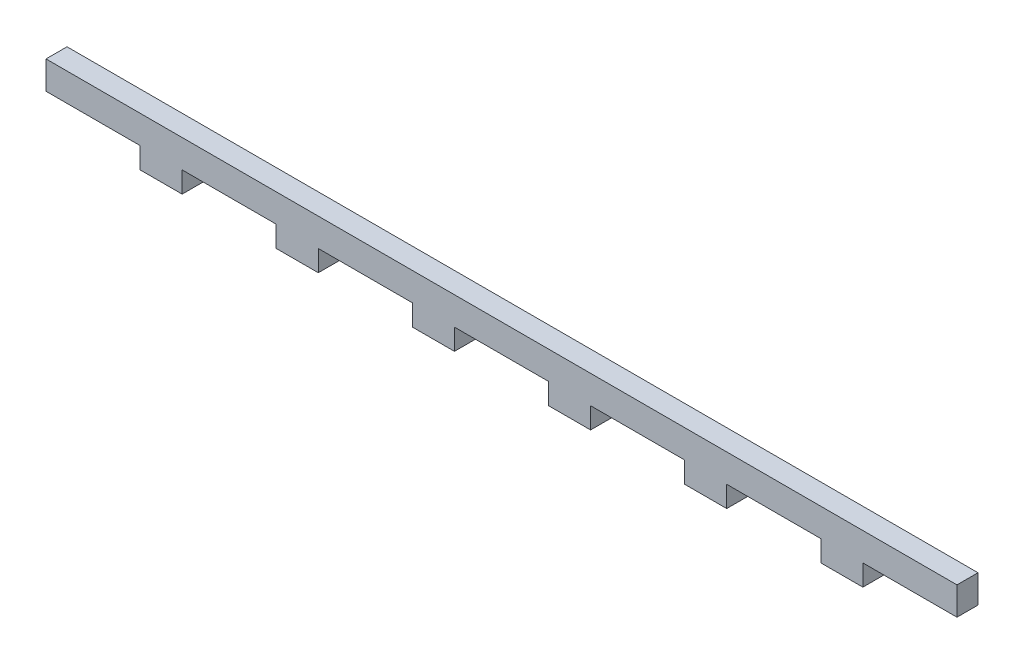
ISO-10303-21;
HEADER;
FILE_DESCRIPTION(('STEP AP214'),'2;1');
FILE_NAME('part.step','',(''),(''),'','','');
FILE_SCHEMA(('AUTOMOTIVE_DESIGN { 1 0 10303 214 1 1 1 1 }'));
ENDSEC;
DATA;
#1=APPLICATION_CONTEXT('core data for automotive mechanical design processes');
#2=APPLICATION_PROTOCOL_DEFINITION('international standard','automotive_design',2000,#1);
#3=PRODUCT_CONTEXT('',#1,'mechanical');
#4=PRODUCT('Part','Part','',(#3));
#5=PRODUCT_RELATED_PRODUCT_CATEGORY('part','',(#4));
#6=PRODUCT_DEFINITION_FORMATION('','',#4);
#7=PRODUCT_DEFINITION_CONTEXT('part definition',#1,'design');
#8=PRODUCT_DEFINITION('design','',#6,#7);
#9=PRODUCT_DEFINITION_SHAPE('','',#8);
#10=(LENGTH_UNIT() NAMED_UNIT(*) SI_UNIT(.MILLI.,.METRE.));
#11=(NAMED_UNIT(*) PLANE_ANGLE_UNIT() SI_UNIT($,.RADIAN.));
#12=(NAMED_UNIT(*) SI_UNIT($,.STERADIAN.) SOLID_ANGLE_UNIT());
#13=UNCERTAINTY_MEASURE_WITH_UNIT(LENGTH_MEASURE(1.E-05),#10,'distance_accuracy_value','');
#14=(GEOMETRIC_REPRESENTATION_CONTEXT(3) GLOBAL_UNCERTAINTY_ASSIGNED_CONTEXT((#13)) GLOBAL_UNIT_ASSIGNED_CONTEXT((#10,
#11,#12)) REPRESENTATION_CONTEXT('',''));
#15=CARTESIAN_POINT('',(0.,0.,0.));
#16=DIRECTION('',(0.,0.,1.));
#17=DIRECTION('',(1.,0.,0.));
#18=AXIS2_PLACEMENT_3D('',#15,#16,#17);
#19=CARTESIAN_POINT('',(-130.,-7.,-6.));
#20=DIRECTION('',(0.,-1.,0.));
#21=DIRECTION('',(0.,0.,-1.));
#22=AXIS2_PLACEMENT_3D('',#19,#20,#21);
#23=PLANE('',#22);
#24=DIRECTION('',(0.,0.,1.));
#25=VECTOR('',#24,1.);
#26=CARTESIAN_POINT('',(103.142857142857,-7.,-6.));
#27=LINE('',#26,#25);
#28=CARTESIAN_POINT('',(103.142857142857,-7.,-6.));
#29=VERTEX_POINT('',#28);
#30=CARTESIAN_POINT('',(103.142857142857,-7.,0.));
#31=VERTEX_POINT('',#30);
#32=EDGE_CURVE('E226',#29,#31,#27,.T.);
#33=ORIENTED_EDGE('',*,*,#32,.T.);
#34=DIRECTION('',(1.,0.,0.));
#35=VECTOR('',#34,1.);
#36=CARTESIAN_POINT('',(-130.,-7.,0.));
#37=LINE('',#36,#35);
#38=CARTESIAN_POINT('',(91.1428571428572,-7.,0.));
#39=VERTEX_POINT('',#38);
#40=EDGE_CURVE('E342',#39,#31,#37,.T.);
#41=ORIENTED_EDGE('',*,*,#40,.F.);
#42=DIRECTION('',(0.,0.,1.));
#43=VECTOR('',#42,1.);
#44=CARTESIAN_POINT('',(91.1428571428572,-7.,-6.));
#45=LINE('',#44,#43);
#46=CARTESIAN_POINT('',(91.1428571428572,-7.,-6.));
#47=VERTEX_POINT('',#46);
#48=EDGE_CURVE('E54',#47,#39,#45,.T.);
#49=ORIENTED_EDGE('',*,*,#48,.F.);
#50=DIRECTION('',(1.,0.,0.));
#51=VECTOR('',#50,1.);
#52=CARTESIAN_POINT('',(-130.,-7.,-6.));
#53=LINE('',#52,#51);
#54=EDGE_CURVE('E244',#47,#29,#53,.T.);
#55=ORIENTED_EDGE('',*,*,#54,.T.);
#56=EDGE_LOOP('',(#33,#41,#49,#55));
#57=FACE_BOUND('',#56,.T.);
#58=ADVANCED_FACE('F39',(#57),#23,.T.);
#59=DIRECTION('',(0.,0.,1.));
#60=VECTOR('',#59,1.);
#61=CARTESIAN_POINT('',(64.2857142857143,-7.,-6.));
#62=LINE('',#61,#60);
#63=CARTESIAN_POINT('',(64.2857142857143,-7.,-6.));
#64=VERTEX_POINT('',#63);
#65=CARTESIAN_POINT('',(64.2857142857143,-7.,0.));
#66=VERTEX_POINT('',#65);
#67=EDGE_CURVE('E306',#64,#66,#62,.T.);
#68=ORIENTED_EDGE('',*,*,#67,.T.);
#69=CARTESIAN_POINT('',(52.2857142857143,-7.,0.));
#70=VERTEX_POINT('',#69);
#71=EDGE_CURVE('E426',#70,#66,#37,.T.);
#72=ORIENTED_EDGE('',*,*,#71,.F.);
#73=DIRECTION('',(0.,0.,1.));
#74=VECTOR('',#73,1.);
#75=CARTESIAN_POINT('',(52.2857142857143,-7.,-6.));
#76=LINE('',#75,#74);
#77=CARTESIAN_POINT('',(52.2857142857143,-7.,-6.));
#78=VERTEX_POINT('',#77);
#79=EDGE_CURVE('E62',#78,#70,#76,.T.);
#80=ORIENTED_EDGE('',*,*,#79,.F.);
#81=EDGE_CURVE('E248',#78,#64,#53,.T.);
#82=ORIENTED_EDGE('',*,*,#81,.T.);
#83=EDGE_LOOP('',(#68,#72,#80,#82));
#84=FACE_BOUND('',#83,.T.);
#85=ADVANCED_FACE('F500',(#84),#23,.T.);
#86=DIRECTION('',(0.,0.,1.));
#87=VECTOR('',#86,1.);
#88=CARTESIAN_POINT('',(25.4285714285714,-7.,-6.));
#89=LINE('',#88,#87);
#90=CARTESIAN_POINT('',(25.4285714285714,-7.,-6.));
#91=VERTEX_POINT('',#90);
#92=CARTESIAN_POINT('',(25.4285714285714,-7.,0.));
#93=VERTEX_POINT('',#92);
#94=EDGE_CURVE('E284',#91,#93,#89,.T.);
#95=ORIENTED_EDGE('',*,*,#94,.T.);
#96=CARTESIAN_POINT('',(13.4285714285714,-7.,0.));
#97=VERTEX_POINT('',#96);
#98=EDGE_CURVE('E422',#97,#93,#37,.T.);
#99=ORIENTED_EDGE('',*,*,#98,.F.);
#100=DIRECTION('',(0.,0.,1.));
#101=VECTOR('',#100,1.);
#102=CARTESIAN_POINT('',(13.4285714285714,-7.,-6.));
#103=LINE('',#102,#101);
#104=CARTESIAN_POINT('',(13.4285714285714,-7.,-6.));
#105=VERTEX_POINT('',#104);
#106=EDGE_CURVE('E286',#105,#97,#103,.T.);
#107=ORIENTED_EDGE('',*,*,#106,.F.);
#108=EDGE_CURVE('E253',#105,#91,#53,.T.);
#109=ORIENTED_EDGE('',*,*,#108,.T.);
#110=EDGE_LOOP('',(#95,#99,#107,#109));
#111=FACE_BOUND('',#110,.T.);
#112=ADVANCED_FACE('F282',(#111),#23,.T.);
#113=CARTESIAN_POINT('',(0.,0.,-6.));
#114=DIRECTION('',(0.,0.,1.));
#115=DIRECTION('',(1.,0.,0.));
#116=AXIS2_PLACEMENT_3D('',#113,#114,#115);
#117=PLANE('',#116);
#118=DIRECTION('',(-1.,0.,0.));
#119=VECTOR('',#118,1.);
#120=CARTESIAN_POINT('',(0.,-1.,-6.));
#121=LINE('',#120,#119);
#122=CARTESIAN_POINT('',(130.,-1.,-6.));
#123=VERTEX_POINT('',#122);
#124=CARTESIAN_POINT('',(103.142857142857,-1.,-6.));
#125=VERTEX_POINT('',#124);
#126=EDGE_CURVE('E238',#123,#125,#121,.T.);
#127=ORIENTED_EDGE('',*,*,#126,.T.);
#128=DIRECTION('',(0.,-1.,0.));
#129=VECTOR('',#128,1.);
#130=CARTESIAN_POINT('',(103.142857142857,0.,-6.));
#131=LINE('',#130,#129);
#132=EDGE_CURVE('E229',#125,#29,#131,.T.);
#133=ORIENTED_EDGE('',*,*,#132,.T.);
#134=ORIENTED_EDGE('',*,*,#54,.F.);
#135=DIRECTION('',(0.,-1.,0.));
#136=VECTOR('',#135,1.);
#137=CARTESIAN_POINT('',(91.1428571428572,0.,-6.));
#138=LINE('',#137,#136);
#139=CARTESIAN_POINT('',(91.1428571428572,-1.,-6.));
#140=VERTEX_POINT('',#139);
#141=EDGE_CURVE('E508',#140,#47,#138,.T.);
#142=ORIENTED_EDGE('',*,*,#141,.F.);
#143=DIRECTION('',(-1.,0.,0.));
#144=VECTOR('',#143,1.);
#145=CARTESIAN_POINT('',(0.,-1.,-6.));
#146=LINE('',#145,#144);
#147=CARTESIAN_POINT('',(64.2857142857143,-1.,-6.));
#148=VERTEX_POINT('',#147);
#149=EDGE_CURVE('E505',#140,#148,#146,.T.);
#150=ORIENTED_EDGE('',*,*,#149,.T.);
#151=DIRECTION('',(0.,-1.,0.));
#152=VECTOR('',#151,1.);
#153=CARTESIAN_POINT('',(64.2857142857143,0.,-6.));
#154=LINE('',#153,#152);
#155=EDGE_CURVE('E511',#148,#64,#154,.T.);
#156=ORIENTED_EDGE('',*,*,#155,.T.);
#157=ORIENTED_EDGE('',*,*,#81,.F.);
#158=DIRECTION('',(0.,-1.,0.));
#159=VECTOR('',#158,1.);
#160=CARTESIAN_POINT('',(52.2857142857143,0.,-6.));
#161=LINE('',#160,#159);
#162=CARTESIAN_POINT('',(52.2857142857143,-1.,-6.));
#163=VERTEX_POINT('',#162);
#164=EDGE_CURVE('E298',#163,#78,#161,.T.);
#165=ORIENTED_EDGE('',*,*,#164,.F.);
#166=DIRECTION('',(-1.,0.,0.));
#167=VECTOR('',#166,1.);
#168=CARTESIAN_POINT('',(0.,-1.,-6.));
#169=LINE('',#168,#167);
#170=CARTESIAN_POINT('',(25.4285714285714,-1.,-6.));
#171=VERTEX_POINT('',#170);
#172=EDGE_CURVE('E296',#163,#171,#169,.T.);
#173=ORIENTED_EDGE('',*,*,#172,.T.);
#174=DIRECTION('',(0.,-1.,0.));
#175=VECTOR('',#174,1.);
#176=CARTESIAN_POINT('',(25.4285714285714,0.,-6.));
#177=LINE('',#176,#175);
#178=EDGE_CURVE('E293',#171,#91,#177,.T.);
#179=ORIENTED_EDGE('',*,*,#178,.T.);
#180=ORIENTED_EDGE('',*,*,#108,.F.);
#181=DIRECTION('',(0.,-1.,0.));
#182=VECTOR('',#181,1.);
#183=CARTESIAN_POINT('',(13.4285714285714,0.,-6.));
#184=LINE('',#183,#182);
#185=CARTESIAN_POINT('',(13.4285714285714,-1.,-6.));
#186=VERTEX_POINT('',#185);
#187=EDGE_CURVE('E290',#186,#105,#184,.T.);
#188=ORIENTED_EDGE('',*,*,#187,.F.);
#189=DIRECTION('',(-1.,0.,0.));
#190=VECTOR('',#189,1.);
#191=CARTESIAN_POINT('',(0.,-1.,-6.));
#192=LINE('',#191,#190);
#193=CARTESIAN_POINT('',(-13.4285714285714,-1.,-6.));
#194=VERTEX_POINT('',#193);
#195=EDGE_CURVE('E396',#186,#194,#192,.T.);
#196=ORIENTED_EDGE('',*,*,#195,.T.);
#197=DIRECTION('',(0.,-1.,0.));
#198=VECTOR('',#197,1.);
#199=CARTESIAN_POINT('',(-13.4285714285714,0.,-6.));
#200=LINE('',#199,#198);
#201=CARTESIAN_POINT('',(-13.4285714285714,-7.,-6.));
#202=VERTEX_POINT('',#201);
#203=EDGE_CURVE('E398',#194,#202,#200,.T.);
#204=ORIENTED_EDGE('',*,*,#203,.T.);
#205=CARTESIAN_POINT('',(-25.4285714285714,-7.,-6.));
#206=VERTEX_POINT('',#205);
#207=EDGE_CURVE('E267',#206,#202,#53,.T.);
#208=ORIENTED_EDGE('',*,*,#207,.F.);
#209=DIRECTION('',(0.,-1.,0.));
#210=VECTOR('',#209,1.);
#211=CARTESIAN_POINT('',(-25.4285714285714,0.,-6.));
#212=LINE('',#211,#210);
#213=CARTESIAN_POINT('',(-25.4285714285714,-1.,-6.));
#214=VERTEX_POINT('',#213);
#215=EDGE_CURVE('E372',#214,#206,#212,.T.);
#216=ORIENTED_EDGE('',*,*,#215,.F.);
#217=DIRECTION('',(1.,0.,0.));
#218=VECTOR('',#217,1.);
#219=CARTESIAN_POINT('',(0.,-1.,-6.));
#220=LINE('',#219,#218);
#221=CARTESIAN_POINT('',(-52.2857142857143,-1.,-6.));
#222=VERTEX_POINT('',#221);
#223=EDGE_CURVE('E374',#222,#214,#220,.T.);
#224=ORIENTED_EDGE('',*,*,#223,.F.);
#225=DIRECTION('',(0.,-1.,0.));
#226=VECTOR('',#225,1.);
#227=CARTESIAN_POINT('',(-52.2857142857143,0.,-6.));
#228=LINE('',#227,#226);
#229=CARTESIAN_POINT('',(-52.2857142857143,-7.,-6.));
#230=VERTEX_POINT('',#229);
#231=EDGE_CURVE('E377',#222,#230,#228,.T.);
#232=ORIENTED_EDGE('',*,*,#231,.T.);
#233=CARTESIAN_POINT('',(-64.2857142857143,-7.,-6.));
#234=VERTEX_POINT('',#233);
#235=EDGE_CURVE('E260',#234,#230,#53,.T.);
#236=ORIENTED_EDGE('',*,*,#235,.F.);
#237=DIRECTION('',(0.,-1.,0.));
#238=VECTOR('',#237,1.);
#239=CARTESIAN_POINT('',(-64.2857142857143,0.,-6.));
#240=LINE('',#239,#238);
#241=CARTESIAN_POINT('',(-64.2857142857143,-1.,-6.));
#242=VERTEX_POINT('',#241);
#243=EDGE_CURVE('E348',#242,#234,#240,.T.);
#244=ORIENTED_EDGE('',*,*,#243,.F.);
#245=DIRECTION('',(1.,0.,0.));
#246=VECTOR('',#245,1.);
#247=CARTESIAN_POINT('',(0.,-1.,-6.));
#248=LINE('',#247,#246);
#249=CARTESIAN_POINT('',(-91.1428571428572,-1.,-6.));
#250=VERTEX_POINT('',#249);
#251=EDGE_CURVE('E350',#250,#242,#248,.T.);
#252=ORIENTED_EDGE('',*,*,#251,.F.);
#253=DIRECTION('',(0.,-1.,0.));
#254=VECTOR('',#253,1.);
#255=CARTESIAN_POINT('',(-91.1428571428572,0.,-6.));
#256=LINE('',#255,#254);
#257=CARTESIAN_POINT('',(-91.1428571428572,-7.,-6.));
#258=VERTEX_POINT('',#257);
#259=EDGE_CURVE('E353',#250,#258,#256,.T.);
#260=ORIENTED_EDGE('',*,*,#259,.T.);
#261=CARTESIAN_POINT('',(-103.142857142857,-7.,-6.));
#262=VERTEX_POINT('',#261);
#263=EDGE_CURVE('E251',#262,#258,#53,.T.);
#264=ORIENTED_EDGE('',*,*,#263,.F.);
#265=DIRECTION('',(0.,-1.,0.));
#266=VECTOR('',#265,1.);
#267=CARTESIAN_POINT('',(-103.142857142857,0.,-6.));
#268=LINE('',#267,#266);
#269=CARTESIAN_POINT('',(-103.142857142857,-1.,-6.));
#270=VERTEX_POINT('',#269);
#271=EDGE_CURVE('E328',#270,#262,#268,.T.);
#272=ORIENTED_EDGE('',*,*,#271,.F.);
#273=DIRECTION('',(1.,0.,0.));
#274=VECTOR('',#273,1.);
#275=CARTESIAN_POINT('',(0.,-1.,-6.));
#276=LINE('',#275,#274);
#277=CARTESIAN_POINT('',(-130.,-1.,-6.));
#278=VERTEX_POINT('',#277);
#279=EDGE_CURVE('E330',#278,#270,#276,.T.);
#280=ORIENTED_EDGE('',*,*,#279,.F.);
#281=DIRECTION('',(0.,1.,0.));
#282=VECTOR('',#281,1.);
#283=CARTESIAN_POINT('',(-130.,-7.,-6.));
#284=LINE('',#283,#282);
#285=CARTESIAN_POINT('',(-130.,7.,-6.));
#286=VERTEX_POINT('',#285);
#287=EDGE_CURVE('E429',#278,#286,#284,.T.);
#288=ORIENTED_EDGE('',*,*,#287,.T.);
#289=DIRECTION('',(1.,0.,0.));
#290=VECTOR('',#289,1.);
#291=CARTESIAN_POINT('',(-130.,7.,-6.));
#292=LINE('',#291,#290);
#293=CARTESIAN_POINT('',(130.,7.,-6.));
#294=VERTEX_POINT('',#293);
#295=EDGE_CURVE('E265',#286,#294,#292,.T.);
#296=ORIENTED_EDGE('',*,*,#295,.T.);
#297=DIRECTION('',(0.,1.,0.));
#298=VECTOR('',#297,1.);
#299=CARTESIAN_POINT('',(130.,-7.,-6.));
#300=LINE('',#299,#298);
#301=EDGE_CURVE('E259',#123,#294,#300,.T.);
#302=ORIENTED_EDGE('',*,*,#301,.F.);
#303=EDGE_LOOP('',(#127,#133,#134,#142,#150,#156,#157,#165,#173,#179,#180,#188,#196,#204,#208,
#216,#224,#232,#236,#244,#252,#260,#264,#272,#280,#288,#296,#302));
#304=FACE_BOUND('',#303,.T.);
#305=ADVANCED_FACE('F242',(#304),#117,.F.);
#306=CARTESIAN_POINT('',(0.,0.,0.));
#307=DIRECTION('',(0.,0.,1.));
#308=DIRECTION('',(1.,0.,0.));
#309=AXIS2_PLACEMENT_3D('',#306,#307,#308);
#310=PLANE('',#309);
#311=DIRECTION('',(0.,-1.,0.));
#312=VECTOR('',#311,1.);
#313=CARTESIAN_POINT('',(103.142857142857,0.,0.));
#314=LINE('',#313,#312);
#315=CARTESIAN_POINT('',(103.142857142857,-1.,0.));
#316=VERTEX_POINT('',#315);
#317=EDGE_CURVE('E232',#316,#31,#314,.T.);
#318=ORIENTED_EDGE('',*,*,#317,.F.);
#319=DIRECTION('',(-1.,0.,0.));
#320=VECTOR('',#319,1.);
#321=CARTESIAN_POINT('',(0.,-1.,0.));
#322=LINE('',#321,#320);
#323=CARTESIAN_POINT('',(130.,-1.,0.));
#324=VERTEX_POINT('',#323);
#325=EDGE_CURVE('E246',#324,#316,#322,.T.);
#326=ORIENTED_EDGE('',*,*,#325,.F.);
#327=DIRECTION('',(0.,1.,0.));
#328=VECTOR('',#327,1.);
#329=CARTESIAN_POINT('',(130.,-7.,0.));
#330=LINE('',#329,#328);
#331=CARTESIAN_POINT('',(130.,7.,0.));
#332=VERTEX_POINT('',#331);
#333=EDGE_CURVE('E431',#324,#332,#330,.T.);
#334=ORIENTED_EDGE('',*,*,#333,.T.);
#335=DIRECTION('',(1.,0.,0.));
#336=VECTOR('',#335,1.);
#337=CARTESIAN_POINT('',(-130.,7.,0.));
#338=LINE('',#337,#336);
#339=CARTESIAN_POINT('',(-130.,7.,0.));
#340=VERTEX_POINT('',#339);
#341=EDGE_CURVE('E254',#340,#332,#338,.T.);
#342=ORIENTED_EDGE('',*,*,#341,.F.);
#343=DIRECTION('',(0.,1.,0.));
#344=VECTOR('',#343,1.);
#345=CARTESIAN_POINT('',(-130.,-7.,0.));
#346=LINE('',#345,#344);
#347=CARTESIAN_POINT('',(-130.,-1.,0.));
#348=VERTEX_POINT('',#347);
#349=EDGE_CURVE('E249',#348,#340,#346,.T.);
#350=ORIENTED_EDGE('',*,*,#349,.F.);
#351=DIRECTION('',(1.,0.,0.));
#352=VECTOR('',#351,1.);
#353=CARTESIAN_POINT('',(0.,-1.,0.));
#354=LINE('',#353,#352);
#355=CARTESIAN_POINT('',(-103.142857142857,-1.,0.));
#356=VERTEX_POINT('',#355);
#357=EDGE_CURVE('E331',#348,#356,#354,.T.);
#358=ORIENTED_EDGE('',*,*,#357,.T.);
#359=DIRECTION('',(0.,-1.,0.));
#360=VECTOR('',#359,1.);
#361=CARTESIAN_POINT('',(-103.142857142857,0.,0.));
#362=LINE('',#361,#360);
#363=CARTESIAN_POINT('',(-103.142857142857,-7.,0.));
#364=VERTEX_POINT('',#363);
#365=EDGE_CURVE('E334',#356,#364,#362,.T.);
#366=ORIENTED_EDGE('',*,*,#365,.T.);
#367=CARTESIAN_POINT('',(-91.1428571428572,-7.,0.));
#368=VERTEX_POINT('',#367);
#369=EDGE_CURVE('E425',#364,#368,#37,.T.);
#370=ORIENTED_EDGE('',*,*,#369,.T.);
#371=DIRECTION('',(0.,-1.,0.));
#372=VECTOR('',#371,1.);
#373=CARTESIAN_POINT('',(-91.1428571428572,0.,0.));
#374=LINE('',#373,#372);
#375=CARTESIAN_POINT('',(-91.1428571428572,-1.,0.));
#376=VERTEX_POINT('',#375);
#377=EDGE_CURVE('E351',#376,#368,#374,.T.);
#378=ORIENTED_EDGE('',*,*,#377,.F.);
#379=DIRECTION('',(1.,0.,0.));
#380=VECTOR('',#379,1.);
#381=CARTESIAN_POINT('',(0.,-1.,0.));
#382=LINE('',#381,#380);
#383=CARTESIAN_POINT('',(-64.2857142857143,-1.,0.));
#384=VERTEX_POINT('',#383);
#385=EDGE_CURVE('E360',#376,#384,#382,.T.);
#386=ORIENTED_EDGE('',*,*,#385,.T.);
#387=DIRECTION('',(0.,-1.,0.));
#388=VECTOR('',#387,1.);
#389=CARTESIAN_POINT('',(-64.2857142857143,0.,0.));
#390=LINE('',#389,#388);
#391=CARTESIAN_POINT('',(-64.2857142857143,-7.,0.));
#392=VERTEX_POINT('',#391);
#393=EDGE_CURVE('E357',#384,#392,#390,.T.);
#394=ORIENTED_EDGE('',*,*,#393,.T.);
#395=CARTESIAN_POINT('',(-52.2857142857143,-7.,0.));
#396=VERTEX_POINT('',#395);
#397=EDGE_CURVE('E421',#392,#396,#37,.T.);
#398=ORIENTED_EDGE('',*,*,#397,.T.);
#399=DIRECTION('',(0.,-1.,0.));
#400=VECTOR('',#399,1.);
#401=CARTESIAN_POINT('',(-52.2857142857143,0.,0.));
#402=LINE('',#401,#400);
#403=CARTESIAN_POINT('',(-52.2857142857143,-1.,0.));
#404=VERTEX_POINT('',#403);
#405=EDGE_CURVE('E375',#404,#396,#402,.T.);
#406=ORIENTED_EDGE('',*,*,#405,.F.);
#407=DIRECTION('',(1.,0.,0.));
#408=VECTOR('',#407,1.);
#409=CARTESIAN_POINT('',(0.,-1.,0.));
#410=LINE('',#409,#408);
#411=CARTESIAN_POINT('',(-25.4285714285714,-1.,0.));
#412=VERTEX_POINT('',#411);
#413=EDGE_CURVE('E384',#404,#412,#410,.T.);
#414=ORIENTED_EDGE('',*,*,#413,.T.);
#415=DIRECTION('',(0.,-1.,0.));
#416=VECTOR('',#415,1.);
#417=CARTESIAN_POINT('',(-25.4285714285714,0.,0.));
#418=LINE('',#417,#416);
#419=CARTESIAN_POINT('',(-25.4285714285714,-7.,0.));
#420=VERTEX_POINT('',#419);
#421=EDGE_CURVE('E381',#412,#420,#418,.T.);
#422=ORIENTED_EDGE('',*,*,#421,.T.);
#423=CARTESIAN_POINT('',(-13.4285714285714,-7.,0.));
#424=VERTEX_POINT('',#423);
#425=EDGE_CURVE('E420',#420,#424,#37,.T.);
#426=ORIENTED_EDGE('',*,*,#425,.T.);
#427=DIRECTION('',(0.,-1.,0.));
#428=VECTOR('',#427,1.);
#429=CARTESIAN_POINT('',(-13.4285714285714,0.,0.));
#430=LINE('',#429,#428);
#431=CARTESIAN_POINT('',(-13.4285714285714,-1.,0.));
#432=VERTEX_POINT('',#431);
#433=EDGE_CURVE('E399',#432,#424,#430,.T.);
#434=ORIENTED_EDGE('',*,*,#433,.F.);
#435=DIRECTION('',(-1.,0.,0.));
#436=VECTOR('',#435,1.);
#437=CARTESIAN_POINT('',(0.,-1.,0.));
#438=LINE('',#437,#436);
#439=CARTESIAN_POINT('',(13.4285714285714,-1.,0.));
#440=VERTEX_POINT('',#439);
#441=EDGE_CURVE('E403',#440,#432,#438,.T.);
#442=ORIENTED_EDGE('',*,*,#441,.F.);
#443=DIRECTION('',(0.,-1.,0.));
#444=VECTOR('',#443,1.);
#445=CARTESIAN_POINT('',(13.4285714285714,0.,0.));
#446=LINE('',#445,#444);
#447=EDGE_CURVE('E322',#440,#97,#446,.T.);
#448=ORIENTED_EDGE('',*,*,#447,.T.);
#449=ORIENTED_EDGE('',*,*,#98,.T.);
#450=DIRECTION('',(0.,-1.,0.));
#451=VECTOR('',#450,1.);
#452=CARTESIAN_POINT('',(25.4285714285714,0.,0.));
#453=LINE('',#452,#451);
#454=CARTESIAN_POINT('',(25.4285714285714,-1.,0.));
#455=VERTEX_POINT('',#454);
#456=EDGE_CURVE('E310',#455,#93,#453,.T.);
#457=ORIENTED_EDGE('',*,*,#456,.F.);
#458=DIRECTION('',(-1.,0.,0.));
#459=VECTOR('',#458,1.);
#460=CARTESIAN_POINT('',(0.,-1.,0.));
#461=LINE('',#460,#459);
#462=CARTESIAN_POINT('',(52.2857142857143,-1.,0.));
#463=VERTEX_POINT('',#462);
#464=EDGE_CURVE('E299',#463,#455,#461,.T.);
#465=ORIENTED_EDGE('',*,*,#464,.F.);
#466=DIRECTION('',(0.,-1.,0.));
#467=VECTOR('',#466,1.);
#468=CARTESIAN_POINT('',(52.2857142857143,0.,0.));
#469=LINE('',#468,#467);
#470=EDGE_CURVE('E303',#463,#70,#469,.T.);
#471=ORIENTED_EDGE('',*,*,#470,.T.);
#472=ORIENTED_EDGE('',*,*,#71,.T.);
#473=DIRECTION('',(0.,-1.,0.));
#474=VECTOR('',#473,1.);
#475=CARTESIAN_POINT('',(64.2857142857143,0.,0.));
#476=LINE('',#475,#474);
#477=CARTESIAN_POINT('',(64.2857142857143,-1.,0.));
#478=VERTEX_POINT('',#477);
#479=EDGE_CURVE('E316',#478,#66,#476,.T.);
#480=ORIENTED_EDGE('',*,*,#479,.F.);
#481=DIRECTION('',(-1.,0.,0.));
#482=VECTOR('',#481,1.);
#483=CARTESIAN_POINT('',(0.,-1.,0.));
#484=LINE('',#483,#482);
#485=CARTESIAN_POINT('',(91.1428571428572,-1.,0.));
#486=VERTEX_POINT('',#485);
#487=EDGE_CURVE('E518',#486,#478,#484,.T.);
#488=ORIENTED_EDGE('',*,*,#487,.F.);
#489=DIRECTION('',(0.,-1.,0.));
#490=VECTOR('',#489,1.);
#491=CARTESIAN_POINT('',(91.1428571428572,0.,0.));
#492=LINE('',#491,#490);
#493=EDGE_CURVE('E516',#486,#39,#492,.T.);
#494=ORIENTED_EDGE('',*,*,#493,.T.);
#495=ORIENTED_EDGE('',*,*,#40,.T.);
#496=EDGE_LOOP('',(#318,#326,#334,#342,#350,#358,#366,#370,#378,#386,#394,#398,#406,#414,#422,
#426,#434,#442,#448,#449,#457,#465,#471,#472,#480,#488,#494,#495));
#497=FACE_BOUND('',#496,.T.);
#498=ADVANCED_FACE('F418',(#497),#310,.T.);
#499=ORIENTED_EDGE('',*,*,#369,.F.);
#500=DIRECTION('',(0.,0.,1.));
#501=VECTOR('',#500,1.);
#502=CARTESIAN_POINT('',(-103.142857142857,-7.,-6.));
#503=LINE('',#502,#501);
#504=EDGE_CURVE('E340',#262,#364,#503,.T.);
#505=ORIENTED_EDGE('',*,*,#504,.F.);
#506=ORIENTED_EDGE('',*,*,#263,.T.);
#507=DIRECTION('',(0.,0.,1.));
#508=VECTOR('',#507,1.);
#509=CARTESIAN_POINT('',(-91.1428571428572,-7.,-6.));
#510=LINE('',#509,#508);
#511=EDGE_CURVE('E366',#258,#368,#510,.T.);
#512=ORIENTED_EDGE('',*,*,#511,.T.);
#513=EDGE_LOOP('',(#499,#505,#506,#512));
#514=FACE_BOUND('',#513,.T.);
#515=ADVANCED_FACE('F41',(#514),#23,.T.);
#516=ORIENTED_EDGE('',*,*,#397,.F.);
#517=DIRECTION('',(0.,0.,1.));
#518=VECTOR('',#517,1.);
#519=CARTESIAN_POINT('',(-64.2857142857143,-7.,-6.));
#520=LINE('',#519,#518);
#521=EDGE_CURVE('E337',#234,#392,#520,.T.);
#522=ORIENTED_EDGE('',*,*,#521,.F.);
#523=ORIENTED_EDGE('',*,*,#235,.T.);
#524=DIRECTION('',(0.,0.,1.));
#525=VECTOR('',#524,1.);
#526=CARTESIAN_POINT('',(-52.2857142857143,-7.,-6.));
#527=LINE('',#526,#525);
#528=EDGE_CURVE('E390',#230,#396,#527,.T.);
#529=ORIENTED_EDGE('',*,*,#528,.T.);
#530=EDGE_LOOP('',(#516,#522,#523,#529));
#531=FACE_BOUND('',#530,.T.);
#532=ADVANCED_FACE('F474',(#531),#23,.T.);
#533=ORIENTED_EDGE('',*,*,#425,.F.);
#534=DIRECTION('',(0.,0.,1.));
#535=VECTOR('',#534,1.);
#536=CARTESIAN_POINT('',(-25.4285714285714,-7.,-6.));
#537=LINE('',#536,#535);
#538=EDGE_CURVE('E361',#206,#420,#537,.T.);
#539=ORIENTED_EDGE('',*,*,#538,.F.);
#540=ORIENTED_EDGE('',*,*,#207,.T.);
#541=DIRECTION('',(0.,0.,1.));
#542=VECTOR('',#541,1.);
#543=CARTESIAN_POINT('',(-13.4285714285714,-7.,-6.));
#544=LINE('',#543,#542);
#545=EDGE_CURVE('E385',#202,#424,#544,.T.);
#546=ORIENTED_EDGE('',*,*,#545,.T.);
#547=EDGE_LOOP('',(#533,#539,#540,#546));
#548=FACE_BOUND('',#547,.T.);
#549=ADVANCED_FACE('F486',(#548),#23,.T.);
#550=CARTESIAN_POINT('',(-130.,-7.,-6.));
#551=DIRECTION('',(1.,0.,0.));
#552=DIRECTION('',(0.,0.,-1.));
#553=AXIS2_PLACEMENT_3D('',#550,#551,#552);
#554=PLANE('',#553);
#555=DIRECTION('',(0.,0.,1.));
#556=VECTOR('',#555,1.);
#557=CARTESIAN_POINT('',(-130.,-1.,-6.));
#558=LINE('',#557,#556);
#559=EDGE_CURVE('E343',#278,#348,#558,.T.);
#560=ORIENTED_EDGE('',*,*,#559,.T.);
#561=ORIENTED_EDGE('',*,*,#349,.T.);
#562=DIRECTION('',(0.,0.,1.));
#563=VECTOR('',#562,1.);
#564=CARTESIAN_POINT('',(-130.,7.,-6.));
#565=LINE('',#564,#563);
#566=EDGE_CURVE('E11',#286,#340,#565,.T.);
#567=ORIENTED_EDGE('',*,*,#566,.F.);
#568=ORIENTED_EDGE('',*,*,#287,.F.);
#569=EDGE_LOOP('',(#560,#561,#567,#568));
#570=FACE_BOUND('',#569,.T.);
#571=ADVANCED_FACE('F453',(#570),#554,.F.);
#572=CARTESIAN_POINT('',(-130.,7.,-6.));
#573=DIRECTION('',(0.,-1.,0.));
#574=DIRECTION('',(0.,0.,-1.));
#575=AXIS2_PLACEMENT_3D('',#572,#573,#574);
#576=PLANE('',#575);
#577=ORIENTED_EDGE('',*,*,#341,.T.);
#578=DIRECTION('',(0.,0.,1.));
#579=VECTOR('',#578,1.);
#580=CARTESIAN_POINT('',(130.,7.,-6.));
#581=LINE('',#580,#579);
#582=EDGE_CURVE('E43',#294,#332,#581,.T.);
#583=ORIENTED_EDGE('',*,*,#582,.F.);
#584=ORIENTED_EDGE('',*,*,#295,.F.);
#585=ORIENTED_EDGE('',*,*,#566,.T.);
#586=EDGE_LOOP('',(#577,#583,#584,#585));
#587=FACE_BOUND('',#586,.T.);
#588=ADVANCED_FACE('F437',(#587),#576,.F.);
#589=CARTESIAN_POINT('',(130.,-7.,-6.));
#590=DIRECTION('',(1.,0.,0.));
#591=DIRECTION('',(0.,0.,-1.));
#592=AXIS2_PLACEMENT_3D('',#589,#590,#591);
#593=PLANE('',#592);
#594=DIRECTION('',(0.,0.,1.));
#595=VECTOR('',#594,1.);
#596=CARTESIAN_POINT('',(130.,-1.,-6.));
#597=LINE('',#596,#595);
#598=EDGE_CURVE('E237',#123,#324,#597,.T.);
#599=ORIENTED_EDGE('',*,*,#598,.F.);
#600=ORIENTED_EDGE('',*,*,#301,.T.);
#601=ORIENTED_EDGE('',*,*,#582,.T.);
#602=ORIENTED_EDGE('',*,*,#333,.F.);
#603=EDGE_LOOP('',(#599,#600,#601,#602));
#604=FACE_BOUND('',#603,.T.);
#605=ADVANCED_FACE('F447',(#604),#593,.T.);
#606=CARTESIAN_POINT('',(-13.4285714285714,0.,-6.));
#607=DIRECTION('',(-1.,0.,0.));
#608=DIRECTION('',(0.,0.,1.));
#609=AXIS2_PLACEMENT_3D('',#606,#607,#608);
#610=PLANE('',#609);
#611=ORIENTED_EDGE('',*,*,#433,.T.);
#612=ORIENTED_EDGE('',*,*,#545,.F.);
#613=ORIENTED_EDGE('',*,*,#203,.F.);
#614=DIRECTION('',(0.,0.,1.));
#615=VECTOR('',#614,1.);
#616=CARTESIAN_POINT('',(-13.4285714285714,-1.,-6.));
#617=LINE('',#616,#615);
#618=EDGE_CURVE('E402',#194,#432,#617,.T.);
#619=ORIENTED_EDGE('',*,*,#618,.T.);
#620=EDGE_LOOP('',(#611,#612,#613,#619));
#621=FACE_BOUND('',#620,.T.);
#622=ADVANCED_FACE('F410',(#621),#610,.F.);
#623=CARTESIAN_POINT('',(0.,-1.,-6.));
#624=DIRECTION('',(0.,1.,0.));
#625=DIRECTION('',(0.,0.,1.));
#626=AXIS2_PLACEMENT_3D('',#623,#624,#625);
#627=PLANE('',#626);
#628=ORIENTED_EDGE('',*,*,#441,.T.);
#629=ORIENTED_EDGE('',*,*,#618,.F.);
#630=ORIENTED_EDGE('',*,*,#195,.F.);
#631=DIRECTION('',(0.,0.,1.));
#632=VECTOR('',#631,1.);
#633=CARTESIAN_POINT('',(13.4285714285714,-1.,-6.));
#634=LINE('',#633,#632);
#635=EDGE_CURVE('E312',#186,#440,#634,.T.);
#636=ORIENTED_EDGE('',*,*,#635,.T.);
#637=EDGE_LOOP('',(#628,#629,#630,#636));
#638=FACE_BOUND('',#637,.T.);
#639=ADVANCED_FACE('F413',(#638),#627,.F.);
#640=CARTESIAN_POINT('',(-25.4285714285714,0.,-6.));
#641=DIRECTION('',(-1.,0.,0.));
#642=DIRECTION('',(0.,0.,1.));
#643=AXIS2_PLACEMENT_3D('',#640,#641,#642);
#644=PLANE('',#643);
#645=ORIENTED_EDGE('',*,*,#421,.F.);
#646=DIRECTION('',(0.,0.,1.));
#647=VECTOR('',#646,1.);
#648=CARTESIAN_POINT('',(-25.4285714285714,-1.,-6.));
#649=LINE('',#648,#647);
#650=EDGE_CURVE('E380',#214,#412,#649,.T.);
#651=ORIENTED_EDGE('',*,*,#650,.F.);
#652=ORIENTED_EDGE('',*,*,#215,.T.);
#653=ORIENTED_EDGE('',*,*,#538,.T.);
#654=EDGE_LOOP('',(#645,#651,#652,#653));
#655=FACE_BOUND('',#654,.T.);
#656=ADVANCED_FACE('F485',(#655),#644,.T.);
#657=CARTESIAN_POINT('',(-52.2857142857143,0.,-6.));
#658=DIRECTION('',(-1.,0.,0.));
#659=DIRECTION('',(0.,0.,1.));
#660=AXIS2_PLACEMENT_3D('',#657,#658,#659);
#661=PLANE('',#660);
#662=ORIENTED_EDGE('',*,*,#405,.T.);
#663=ORIENTED_EDGE('',*,*,#528,.F.);
#664=ORIENTED_EDGE('',*,*,#231,.F.);
#665=DIRECTION('',(0.,0.,1.));
#666=VECTOR('',#665,1.);
#667=CARTESIAN_POINT('',(-52.2857142857143,-1.,-6.));
#668=LINE('',#667,#666);
#669=EDGE_CURVE('E392',#222,#404,#668,.T.);
#670=ORIENTED_EDGE('',*,*,#669,.T.);
#671=EDGE_LOOP('',(#662,#663,#664,#670));
#672=FACE_BOUND('',#671,.T.);
#673=ADVANCED_FACE('F477',(#672),#661,.F.);
#674=CARTESIAN_POINT('',(0.,-1.,-6.));
#675=DIRECTION('',(0.,-1.,0.));
#676=DIRECTION('',(0.,0.,-1.));
#677=AXIS2_PLACEMENT_3D('',#674,#675,#676);
#678=PLANE('',#677);
#679=ORIENTED_EDGE('',*,*,#413,.F.);
#680=ORIENTED_EDGE('',*,*,#669,.F.);
#681=ORIENTED_EDGE('',*,*,#223,.T.);
#682=ORIENTED_EDGE('',*,*,#650,.T.);
#683=EDGE_LOOP('',(#679,#680,#681,#682));
#684=FACE_BOUND('',#683,.T.);
#685=ADVANCED_FACE('F483',(#684),#678,.T.);
#686=CARTESIAN_POINT('',(-64.2857142857143,0.,-6.));
#687=DIRECTION('',(-1.,0.,0.));
#688=DIRECTION('',(0.,0.,1.));
#689=AXIS2_PLACEMENT_3D('',#686,#687,#688);
#690=PLANE('',#689);
#691=ORIENTED_EDGE('',*,*,#393,.F.);
#692=DIRECTION('',(0.,0.,1.));
#693=VECTOR('',#692,1.);
#694=CARTESIAN_POINT('',(-64.2857142857143,-1.,-6.));
#695=LINE('',#694,#693);
#696=EDGE_CURVE('E356',#242,#384,#695,.T.);
#697=ORIENTED_EDGE('',*,*,#696,.F.);
#698=ORIENTED_EDGE('',*,*,#243,.T.);
#699=ORIENTED_EDGE('',*,*,#521,.T.);
#700=EDGE_LOOP('',(#691,#697,#698,#699));
#701=FACE_BOUND('',#700,.T.);
#702=ADVANCED_FACE('F471',(#701),#690,.T.);
#703=CARTESIAN_POINT('',(-91.1428571428572,0.,-6.));
#704=DIRECTION('',(-1.,0.,0.));
#705=DIRECTION('',(0.,0.,1.));
#706=AXIS2_PLACEMENT_3D('',#703,#704,#705);
#707=PLANE('',#706);
#708=ORIENTED_EDGE('',*,*,#377,.T.);
#709=ORIENTED_EDGE('',*,*,#511,.F.);
#710=ORIENTED_EDGE('',*,*,#259,.F.);
#711=DIRECTION('',(0.,0.,1.));
#712=VECTOR('',#711,1.);
#713=CARTESIAN_POINT('',(-91.1428571428572,-1.,-6.));
#714=LINE('',#713,#712);
#715=EDGE_CURVE('E368',#250,#376,#714,.T.);
#716=ORIENTED_EDGE('',*,*,#715,.T.);
#717=EDGE_LOOP('',(#708,#709,#710,#716));
#718=FACE_BOUND('',#717,.T.);
#719=ADVANCED_FACE('F463',(#718),#707,.F.);
#720=CARTESIAN_POINT('',(0.,-1.,-6.));
#721=DIRECTION('',(0.,-1.,0.));
#722=DIRECTION('',(0.,0.,-1.));
#723=AXIS2_PLACEMENT_3D('',#720,#721,#722);
#724=PLANE('',#723);
#725=ORIENTED_EDGE('',*,*,#385,.F.);
#726=ORIENTED_EDGE('',*,*,#715,.F.);
#727=ORIENTED_EDGE('',*,*,#251,.T.);
#728=ORIENTED_EDGE('',*,*,#696,.T.);
#729=EDGE_LOOP('',(#725,#726,#727,#728));
#730=FACE_BOUND('',#729,.T.);
#731=ADVANCED_FACE('F469',(#730),#724,.T.);
#732=CARTESIAN_POINT('',(-103.142857142857,0.,-6.));
#733=DIRECTION('',(-1.,0.,0.));
#734=DIRECTION('',(0.,0.,1.));
#735=AXIS2_PLACEMENT_3D('',#732,#733,#734);
#736=PLANE('',#735);
#737=ORIENTED_EDGE('',*,*,#365,.F.);
#738=DIRECTION('',(0.,0.,1.));
#739=VECTOR('',#738,1.);
#740=CARTESIAN_POINT('',(-103.142857142857,-1.,-6.));
#741=LINE('',#740,#739);
#742=EDGE_CURVE('E333',#270,#356,#741,.T.);
#743=ORIENTED_EDGE('',*,*,#742,.F.);
#744=ORIENTED_EDGE('',*,*,#271,.T.);
#745=ORIENTED_EDGE('',*,*,#504,.T.);
#746=EDGE_LOOP('',(#737,#743,#744,#745));
#747=FACE_BOUND('',#746,.T.);
#748=ADVANCED_FACE('F600',(#747),#736,.T.);
#749=CARTESIAN_POINT('',(0.,-1.,-6.));
#750=DIRECTION('',(0.,-1.,0.));
#751=DIRECTION('',(0.,0.,-1.));
#752=AXIS2_PLACEMENT_3D('',#749,#750,#751);
#753=PLANE('',#752);
#754=ORIENTED_EDGE('',*,*,#357,.F.);
#755=ORIENTED_EDGE('',*,*,#559,.F.);
#756=ORIENTED_EDGE('',*,*,#279,.T.);
#757=ORIENTED_EDGE('',*,*,#742,.T.);
#758=EDGE_LOOP('',(#754,#755,#756,#757));
#759=FACE_BOUND('',#758,.T.);
#760=ADVANCED_FACE('F455',(#759),#753,.T.);
#761=CARTESIAN_POINT('',(13.4285714285714,0.,-6.));
#762=DIRECTION('',(-1.,0.,0.));
#763=DIRECTION('',(0.,0.,1.));
#764=AXIS2_PLACEMENT_3D('',#761,#762,#763);
#765=PLANE('',#764);
#766=ORIENTED_EDGE('',*,*,#447,.F.);
#767=ORIENTED_EDGE('',*,*,#635,.F.);
#768=ORIENTED_EDGE('',*,*,#187,.T.);
#769=ORIENTED_EDGE('',*,*,#106,.T.);
#770=EDGE_LOOP('',(#766,#767,#768,#769));
#771=FACE_BOUND('',#770,.T.);
#772=ADVANCED_FACE('F488',(#771),#765,.T.);
#773=CARTESIAN_POINT('',(103.142857142857,0.,-6.));
#774=DIRECTION('',(-1.,0.,0.));
#775=DIRECTION('',(0.,0.,1.));
#776=AXIS2_PLACEMENT_3D('',#773,#774,#775);
#777=PLANE('',#776);
#778=ORIENTED_EDGE('',*,*,#317,.T.);
#779=ORIENTED_EDGE('',*,*,#32,.F.);
#780=ORIENTED_EDGE('',*,*,#132,.F.);
#781=DIRECTION('',(0.,0.,1.));
#782=VECTOR('',#781,1.);
#783=CARTESIAN_POINT('',(103.142857142857,-1.,-6.));
#784=LINE('',#783,#782);
#785=EDGE_CURVE('E406',#125,#316,#784,.T.);
#786=ORIENTED_EDGE('',*,*,#785,.T.);
#787=EDGE_LOOP('',(#778,#779,#780,#786));
#788=FACE_BOUND('',#787,.T.);
#789=ADVANCED_FACE('F228',(#788),#777,.F.);
#790=CARTESIAN_POINT('',(0.,-1.,-6.));
#791=DIRECTION('',(0.,1.,0.));
#792=DIRECTION('',(0.,0.,1.));
#793=AXIS2_PLACEMENT_3D('',#790,#791,#792);
#794=PLANE('',#793);
#795=ORIENTED_EDGE('',*,*,#325,.T.);
#796=ORIENTED_EDGE('',*,*,#785,.F.);
#797=ORIENTED_EDGE('',*,*,#126,.F.);
#798=ORIENTED_EDGE('',*,*,#598,.T.);
#799=EDGE_LOOP('',(#795,#796,#797,#798));
#800=FACE_BOUND('',#799,.T.);
#801=ADVANCED_FACE('F534',(#800),#794,.F.);
#802=CARTESIAN_POINT('',(25.4285714285714,0.,-6.));
#803=DIRECTION('',(-1.,0.,0.));
#804=DIRECTION('',(0.,0.,1.));
#805=AXIS2_PLACEMENT_3D('',#802,#803,#804);
#806=PLANE('',#805);
#807=ORIENTED_EDGE('',*,*,#456,.T.);
#808=ORIENTED_EDGE('',*,*,#94,.F.);
#809=ORIENTED_EDGE('',*,*,#178,.F.);
#810=DIRECTION('',(0.,0.,1.));
#811=VECTOR('',#810,1.);
#812=CARTESIAN_POINT('',(25.4285714285714,-1.,-6.));
#813=LINE('',#812,#811);
#814=EDGE_CURVE('E314',#171,#455,#813,.T.);
#815=ORIENTED_EDGE('',*,*,#814,.T.);
#816=EDGE_LOOP('',(#807,#808,#809,#815));
#817=FACE_BOUND('',#816,.T.);
#818=ADVANCED_FACE('F491',(#817),#806,.F.);
#819=CARTESIAN_POINT('',(0.,-1.,-6.));
#820=DIRECTION('',(0.,1.,0.));
#821=DIRECTION('',(0.,0.,1.));
#822=AXIS2_PLACEMENT_3D('',#819,#820,#821);
#823=PLANE('',#822);
#824=ORIENTED_EDGE('',*,*,#464,.T.);
#825=ORIENTED_EDGE('',*,*,#814,.F.);
#826=ORIENTED_EDGE('',*,*,#172,.F.);
#827=DIRECTION('',(0.,0.,1.));
#828=VECTOR('',#827,1.);
#829=CARTESIAN_POINT('',(52.2857142857143,-1.,-6.));
#830=LINE('',#829,#828);
#831=EDGE_CURVE('E317',#163,#463,#830,.T.);
#832=ORIENTED_EDGE('',*,*,#831,.T.);
#833=EDGE_LOOP('',(#824,#825,#826,#832));
#834=FACE_BOUND('',#833,.T.);
#835=ADVANCED_FACE('F493',(#834),#823,.F.);
#836=CARTESIAN_POINT('',(52.2857142857143,0.,-6.));
#837=DIRECTION('',(-1.,0.,0.));
#838=DIRECTION('',(0.,0.,1.));
#839=AXIS2_PLACEMENT_3D('',#836,#837,#838);
#840=PLANE('',#839);
#841=ORIENTED_EDGE('',*,*,#470,.F.);
#842=ORIENTED_EDGE('',*,*,#831,.F.);
#843=ORIENTED_EDGE('',*,*,#164,.T.);
#844=ORIENTED_EDGE('',*,*,#79,.T.);
#845=EDGE_LOOP('',(#841,#842,#843,#844));
#846=FACE_BOUND('',#845,.T.);
#847=ADVANCED_FACE('F494',(#846),#840,.T.);
#848=CARTESIAN_POINT('',(64.2857142857143,0.,-6.));
#849=DIRECTION('',(-1.,0.,0.));
#850=DIRECTION('',(0.,0.,1.));
#851=AXIS2_PLACEMENT_3D('',#848,#849,#850);
#852=PLANE('',#851);
#853=ORIENTED_EDGE('',*,*,#479,.T.);
#854=ORIENTED_EDGE('',*,*,#67,.F.);
#855=ORIENTED_EDGE('',*,*,#155,.F.);
#856=DIRECTION('',(0.,0.,1.));
#857=VECTOR('',#856,1.);
#858=CARTESIAN_POINT('',(64.2857142857143,-1.,-6.));
#859=LINE('',#858,#857);
#860=EDGE_CURVE('E521',#148,#478,#859,.T.);
#861=ORIENTED_EDGE('',*,*,#860,.T.);
#862=EDGE_LOOP('',(#853,#854,#855,#861));
#863=FACE_BOUND('',#862,.T.);
#864=ADVANCED_FACE('F527',(#863),#852,.F.);
#865=CARTESIAN_POINT('',(0.,-1.,-6.));
#866=DIRECTION('',(0.,1.,0.));
#867=DIRECTION('',(0.,0.,1.));
#868=AXIS2_PLACEMENT_3D('',#865,#866,#867);
#869=PLANE('',#868);
#870=ORIENTED_EDGE('',*,*,#487,.T.);
#871=ORIENTED_EDGE('',*,*,#860,.F.);
#872=ORIENTED_EDGE('',*,*,#149,.F.);
#873=DIRECTION('',(0.,0.,1.));
#874=VECTOR('',#873,1.);
#875=CARTESIAN_POINT('',(91.1428571428572,-1.,-6.));
#876=LINE('',#875,#874);
#877=EDGE_CURVE('E506',#140,#486,#876,.T.);
#878=ORIENTED_EDGE('',*,*,#877,.T.);
#879=EDGE_LOOP('',(#870,#871,#872,#878));
#880=FACE_BOUND('',#879,.T.);
#881=ADVANCED_FACE('F524',(#880),#869,.F.);
#882=CARTESIAN_POINT('',(91.1428571428572,0.,-6.));
#883=DIRECTION('',(-1.,0.,0.));
#884=DIRECTION('',(0.,0.,1.));
#885=AXIS2_PLACEMENT_3D('',#882,#883,#884);
#886=PLANE('',#885);
#887=ORIENTED_EDGE('',*,*,#493,.F.);
#888=ORIENTED_EDGE('',*,*,#877,.F.);
#889=ORIENTED_EDGE('',*,*,#141,.T.);
#890=ORIENTED_EDGE('',*,*,#48,.T.);
#891=EDGE_LOOP('',(#887,#888,#889,#890));
#892=FACE_BOUND('',#891,.T.);
#893=ADVANCED_FACE('F526',(#892),#886,.T.);
#894=CLOSED_SHELL('',(#58,#85,#112,#305,#498,#515,#532,#549,#571,#588,#605,#622,#639,#656,#673,
#685,#702,#719,#731,#748,#760,#772,#789,#801,#818,#835,#847,#864,#881,#893));
#895=MANIFOLD_SOLID_BREP('B2',#894);
#896=ADVANCED_BREP_SHAPE_REPRESENTATION('',(#18,#895),#14);
#897=SHAPE_DEFINITION_REPRESENTATION(#9,#896);
ENDSEC;
END-ISO-10303-21;
